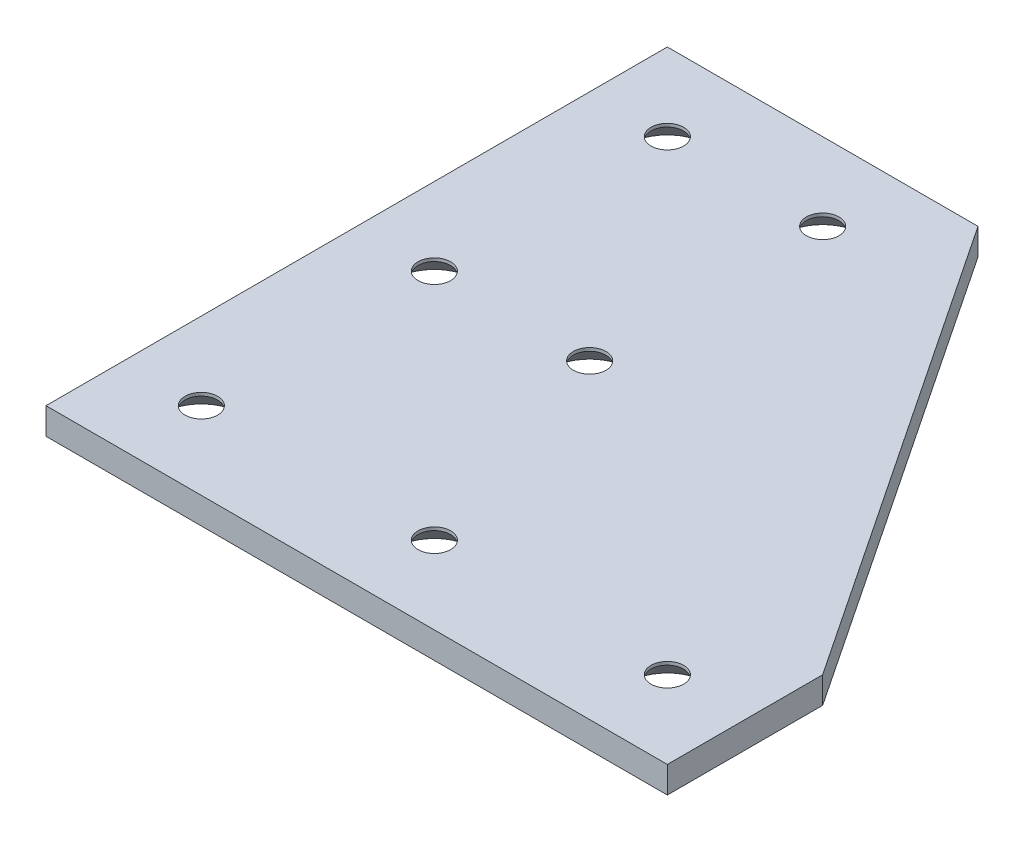
ISO-10303-21;
HEADER;
FILE_DESCRIPTION(('STEP AP214'),'2;1');
FILE_NAME('part.step','',(''),(''),'','','');
FILE_SCHEMA(('AUTOMOTIVE_DESIGN { 1 0 10303 214 1 1 1 1 }'));
ENDSEC;
DATA;
#1=APPLICATION_CONTEXT('core data for automotive mechanical design processes');
#2=APPLICATION_PROTOCOL_DEFINITION('international standard','automotive_design',2000,#1);
#3=PRODUCT_CONTEXT('',#1,'mechanical');
#4=PRODUCT('Part','Part','',(#3));
#5=PRODUCT_RELATED_PRODUCT_CATEGORY('part','',(#4));
#6=PRODUCT_DEFINITION_FORMATION('','',#4);
#7=PRODUCT_DEFINITION_CONTEXT('part definition',#1,'design');
#8=PRODUCT_DEFINITION('design','',#6,#7);
#9=PRODUCT_DEFINITION_SHAPE('','',#8);
#10=(LENGTH_UNIT() NAMED_UNIT(*) SI_UNIT(.MILLI.,.METRE.));
#11=(NAMED_UNIT(*) PLANE_ANGLE_UNIT() SI_UNIT($,.RADIAN.));
#12=(NAMED_UNIT(*) SI_UNIT($,.STERADIAN.) SOLID_ANGLE_UNIT());
#13=UNCERTAINTY_MEASURE_WITH_UNIT(LENGTH_MEASURE(1.E-05),#10,'distance_accuracy_value','');
#14=(GEOMETRIC_REPRESENTATION_CONTEXT(3) GLOBAL_UNCERTAINTY_ASSIGNED_CONTEXT((#13)) GLOBAL_UNIT_ASSIGNED_CONTEXT((#10,
#11,#12)) REPRESENTATION_CONTEXT('',''));
#15=CARTESIAN_POINT('',(0.,0.,0.));
#16=DIRECTION('',(0.,0.,1.));
#17=DIRECTION('',(1.,0.,0.));
#18=AXIS2_PLACEMENT_3D('',#15,#16,#17);
#19=CARTESIAN_POINT('',(0.,3.416,-80.));
#20=DIRECTION('',(1.,0.,0.));
#21=DIRECTION('',(0.,0.,-1.));
#22=AXIS2_PLACEMENT_3D('',#19,#20,#21);
#23=PLANE('',#22);
#24=DIRECTION('',(0.,0.,1.));
#25=VECTOR('',#24,1.);
#26=CARTESIAN_POINT('',(0.,0.,-80.));
#27=LINE('',#26,#25);
#28=CARTESIAN_POINT('',(0.,0.,-80.));
#29=VERTEX_POINT('',#28);
#30=CARTESIAN_POINT('',(0.,0.,0.));
#31=VERTEX_POINT('',#30);
#32=EDGE_CURVE('E128',#29,#31,#27,.T.);
#33=ORIENTED_EDGE('',*,*,#32,.T.);
#34=DIRECTION('',(0.,-1.,0.));
#35=VECTOR('',#34,1.);
#36=CARTESIAN_POINT('',(0.,3.416,0.));
#37=LINE('',#36,#35);
#38=CARTESIAN_POINT('',(0.,3.416,0.));
#39=VERTEX_POINT('',#38);
#40=EDGE_CURVE('E149',#39,#31,#37,.T.);
#41=ORIENTED_EDGE('',*,*,#40,.F.);
#42=DIRECTION('',(0.,0.,1.));
#43=VECTOR('',#42,1.);
#44=CARTESIAN_POINT('',(0.,3.416,-80.));
#45=LINE('',#44,#43);
#46=CARTESIAN_POINT('',(0.,3.416,-80.));
#47=VERTEX_POINT('',#46);
#48=EDGE_CURVE('E142',#47,#39,#45,.T.);
#49=ORIENTED_EDGE('',*,*,#48,.F.);
#50=DIRECTION('',(0.,-1.,0.));
#51=VECTOR('',#50,1.);
#52=CARTESIAN_POINT('',(0.,3.416,-80.));
#53=LINE('',#52,#51);
#54=EDGE_CURVE('E124',#47,#29,#53,.T.);
#55=ORIENTED_EDGE('',*,*,#54,.T.);
#56=EDGE_LOOP('',(#33,#41,#49,#55));
#57=FACE_BOUND('',#56,.T.);
#58=ADVANCED_FACE('F45',(#57),#23,.F.);
#59=CARTESIAN_POINT('',(0.,3.416,0.));
#60=DIRECTION('',(0.,0.,-1.));
#61=DIRECTION('',(-1.,0.,0.));
#62=AXIS2_PLACEMENT_3D('',#59,#60,#61);
#63=PLANE('',#62);
#64=DIRECTION('',(1.,0.,0.));
#65=VECTOR('',#64,1.);
#66=CARTESIAN_POINT('',(0.,0.,0.));
#67=LINE('',#66,#65);
#68=CARTESIAN_POINT('',(80.,0.,0.));
#69=VERTEX_POINT('',#68);
#70=EDGE_CURVE('E132',#31,#69,#67,.T.);
#71=ORIENTED_EDGE('',*,*,#70,.T.);
#72=DIRECTION('',(0.,-1.,0.));
#73=VECTOR('',#72,1.);
#74=CARTESIAN_POINT('',(80.,3.416,0.));
#75=LINE('',#74,#73);
#76=CARTESIAN_POINT('',(80.,3.416,0.));
#77=VERTEX_POINT('',#76);
#78=EDGE_CURVE('E117',#77,#69,#75,.T.);
#79=ORIENTED_EDGE('',*,*,#78,.F.);
#80=DIRECTION('',(1.,0.,0.));
#81=VECTOR('',#80,1.);
#82=CARTESIAN_POINT('',(0.,3.416,0.));
#83=LINE('',#82,#81);
#84=EDGE_CURVE('E99',#39,#77,#83,.T.);
#85=ORIENTED_EDGE('',*,*,#84,.F.);
#86=ORIENTED_EDGE('',*,*,#40,.T.);
#87=EDGE_LOOP('',(#71,#79,#85,#86));
#88=FACE_BOUND('',#87,.T.);
#89=ADVANCED_FACE('F235',(#88),#63,.F.);
#90=CARTESIAN_POINT('',(80.,3.416,0.));
#91=DIRECTION('',(-1.,0.,0.));
#92=DIRECTION('',(0.,0.,1.));
#93=AXIS2_PLACEMENT_3D('',#90,#91,#92);
#94=PLANE('',#93);
#95=DIRECTION('',(0.,0.,-1.));
#96=VECTOR('',#95,1.);
#97=CARTESIAN_POINT('',(80.,0.,0.));
#98=LINE('',#97,#96);
#99=CARTESIAN_POINT('',(80.,0.,-20.));
#100=VERTEX_POINT('',#99);
#101=EDGE_CURVE('E115',#69,#100,#98,.T.);
#102=ORIENTED_EDGE('',*,*,#101,.T.);
#103=DIRECTION('',(0.,-1.,0.));
#104=VECTOR('',#103,1.);
#105=CARTESIAN_POINT('',(80.,3.416,-20.));
#106=LINE('',#105,#104);
#107=CARTESIAN_POINT('',(80.,3.416,-20.));
#108=VERTEX_POINT('',#107);
#109=EDGE_CURVE('E112',#108,#100,#106,.T.);
#110=ORIENTED_EDGE('',*,*,#109,.F.);
#111=DIRECTION('',(0.,0.,-1.));
#112=VECTOR('',#111,1.);
#113=CARTESIAN_POINT('',(80.,3.416,0.));
#114=LINE('',#113,#112);
#115=EDGE_CURVE('E103',#77,#108,#114,.T.);
#116=ORIENTED_EDGE('',*,*,#115,.F.);
#117=ORIENTED_EDGE('',*,*,#78,.T.);
#118=EDGE_LOOP('',(#102,#110,#116,#117));
#119=FACE_BOUND('',#118,.T.);
#120=ADVANCED_FACE('F113',(#119),#94,.F.);
#121=CARTESIAN_POINT('',(80.,3.416,-20.));
#122=DIRECTION('',(-0.832050294337844,0.,0.554700196225229));
#123=DIRECTION('',(0.554700196225229,0.,0.832050294337844));
#124=AXIS2_PLACEMENT_3D('',#121,#122,#123);
#125=PLANE('',#124);
#126=DIRECTION('',(-0.554700196225229,0.,-0.832050294337844));
#127=VECTOR('',#126,1.);
#128=CARTESIAN_POINT('',(80.,0.,-20.));
#129=LINE('',#128,#127);
#130=CARTESIAN_POINT('',(40.,0.,-80.));
#131=VERTEX_POINT('',#130);
#132=EDGE_CURVE('E84',#100,#131,#129,.T.);
#133=ORIENTED_EDGE('',*,*,#132,.T.);
#134=DIRECTION('',(0.,-1.,0.));
#135=VECTOR('',#134,1.);
#136=CARTESIAN_POINT('',(40.,3.416,-80.));
#137=LINE('',#136,#135);
#138=CARTESIAN_POINT('',(40.,3.416,-80.));
#139=VERTEX_POINT('',#138);
#140=EDGE_CURVE('E118',#139,#131,#137,.T.);
#141=ORIENTED_EDGE('',*,*,#140,.F.);
#142=DIRECTION('',(-0.554700196225229,0.,-0.832050294337844));
#143=VECTOR('',#142,1.);
#144=CARTESIAN_POINT('',(80.,3.416,-20.));
#145=LINE('',#144,#143);
#146=EDGE_CURVE('E107',#108,#139,#145,.T.);
#147=ORIENTED_EDGE('',*,*,#146,.F.);
#148=ORIENTED_EDGE('',*,*,#109,.T.);
#149=EDGE_LOOP('',(#133,#141,#147,#148));
#150=FACE_BOUND('',#149,.T.);
#151=ADVANCED_FACE('F120',(#150),#125,.F.);
#152=CARTESIAN_POINT('',(40.,3.416,-80.));
#153=DIRECTION('',(0.,0.,1.));
#154=DIRECTION('',(1.,0.,0.));
#155=AXIS2_PLACEMENT_3D('',#152,#153,#154);
#156=PLANE('',#155);
#157=DIRECTION('',(-1.,0.,0.));
#158=VECTOR('',#157,1.);
#159=CARTESIAN_POINT('',(40.,0.,-80.));
#160=LINE('',#159,#158);
#161=EDGE_CURVE('E90',#131,#29,#160,.T.);
#162=ORIENTED_EDGE('',*,*,#161,.T.);
#163=ORIENTED_EDGE('',*,*,#54,.F.);
#164=DIRECTION('',(-1.,0.,0.));
#165=VECTOR('',#164,1.);
#166=CARTESIAN_POINT('',(40.,3.416,-80.));
#167=LINE('',#166,#165);
#168=EDGE_CURVE('E64',#139,#47,#167,.T.);
#169=ORIENTED_EDGE('',*,*,#168,.F.);
#170=ORIENTED_EDGE('',*,*,#140,.T.);
#171=EDGE_LOOP('',(#162,#163,#169,#170));
#172=FACE_BOUND('',#171,.T.);
#173=ADVANCED_FACE('F224',(#172),#156,.F.);
#174=CARTESIAN_POINT('',(0.,3.416,0.));
#175=DIRECTION('',(0.,1.,0.));
#176=DIRECTION('',(0.,0.,1.));
#177=AXIS2_PLACEMENT_3D('',#174,#175,#176);
#178=PLANE('',#177);
#179=CARTESIAN_POINT('',(9.99999999999979,3.416,-70.));
#180=DIRECTION('',(0.,1.,0.));
#181=DIRECTION('',(0.,0.,1.));
#182=AXIS2_PLACEMENT_3D('',#179,#180,#181);
#183=CIRCLE('',#182,2.1);
#184=CARTESIAN_POINT('',(9.99999999999979,3.416,-67.9));
#185=VERTEX_POINT('',#184);
#186=EDGE_CURVE('E304',#185,#185,#183,.T.);
#187=ORIENTED_EDGE('',*,*,#186,.F.);
#188=EDGE_LOOP('',(#187));
#189=FACE_BOUND('',#188,.T.);
#190=CARTESIAN_POINT('',(9.9999999999999,3.416,-40.));
#191=DIRECTION('',(0.,1.,0.));
#192=DIRECTION('',(0.,0.,1.));
#193=AXIS2_PLACEMENT_3D('',#190,#191,#192);
#194=CIRCLE('',#193,2.1);
#195=CARTESIAN_POINT('',(9.9999999999999,3.416,-37.9));
#196=VERTEX_POINT('',#195);
#197=EDGE_CURVE('E310',#196,#196,#194,.T.);
#198=ORIENTED_EDGE('',*,*,#197,.F.);
#199=EDGE_LOOP('',(#198));
#200=FACE_BOUND('',#199,.T.);
#201=CARTESIAN_POINT('',(29.9999999999998,3.416,-70.));
#202=DIRECTION('',(0.,1.,0.));
#203=DIRECTION('',(0.,0.,1.));
#204=AXIS2_PLACEMENT_3D('',#201,#202,#203);
#205=CIRCLE('',#204,2.1);
#206=CARTESIAN_POINT('',(29.9999999999998,3.416,-67.9));
#207=VERTEX_POINT('',#206);
#208=EDGE_CURVE('E314',#207,#207,#205,.T.);
#209=ORIENTED_EDGE('',*,*,#208,.F.);
#210=EDGE_LOOP('',(#209));
#211=FACE_BOUND('',#210,.T.);
#212=CARTESIAN_POINT('',(29.9999999999999,3.416,-40.));
#213=DIRECTION('',(0.,1.,0.));
#214=DIRECTION('',(0.,0.,1.));
#215=AXIS2_PLACEMENT_3D('',#212,#213,#214);
#216=CIRCLE('',#215,2.1);
#217=CARTESIAN_POINT('',(29.9999999999999,3.416,-37.9));
#218=VERTEX_POINT('',#217);
#219=EDGE_CURVE('E318',#218,#218,#216,.T.);
#220=ORIENTED_EDGE('',*,*,#219,.F.);
#221=EDGE_LOOP('',(#220));
#222=FACE_BOUND('',#221,.T.);
#223=CARTESIAN_POINT('',(70.,3.416,-9.99999999999999));
#224=DIRECTION('',(0.,1.,0.));
#225=DIRECTION('',(0.,0.,1.));
#226=AXIS2_PLACEMENT_3D('',#223,#224,#225);
#227=CIRCLE('',#226,2.1);
#228=CARTESIAN_POINT('',(70.,3.416,-7.89999999999999));
#229=VERTEX_POINT('',#228);
#230=EDGE_CURVE('E300',#229,#229,#227,.T.);
#231=ORIENTED_EDGE('',*,*,#230,.F.);
#232=EDGE_LOOP('',(#231));
#233=FACE_BOUND('',#232,.T.);
#234=CARTESIAN_POINT('',(40.,3.416,-9.99999999999999));
#235=DIRECTION('',(0.,1.,0.));
#236=DIRECTION('',(0.,0.,1.));
#237=AXIS2_PLACEMENT_3D('',#234,#235,#236);
#238=CIRCLE('',#237,2.1);
#239=CARTESIAN_POINT('',(40.,3.416,-7.9));
#240=VERTEX_POINT('',#239);
#241=EDGE_CURVE('E296',#240,#240,#238,.T.);
#242=ORIENTED_EDGE('',*,*,#241,.F.);
#243=EDGE_LOOP('',(#242));
#244=FACE_BOUND('',#243,.T.);
#245=CARTESIAN_POINT('',(10.,3.416,-9.99999999999999));
#246=DIRECTION('',(0.,1.,0.));
#247=DIRECTION('',(0.,0.,1.));
#248=AXIS2_PLACEMENT_3D('',#245,#246,#247);
#249=CIRCLE('',#248,2.1);
#250=CARTESIAN_POINT('',(10.,3.416,-7.89999999999999));
#251=VERTEX_POINT('',#250);
#252=EDGE_CURVE('E133',#251,#251,#249,.T.);
#253=ORIENTED_EDGE('',*,*,#252,.F.);
#254=EDGE_LOOP('',(#253));
#255=FACE_BOUND('',#254,.T.);
#256=ORIENTED_EDGE('',*,*,#48,.T.);
#257=ORIENTED_EDGE('',*,*,#84,.T.);
#258=ORIENTED_EDGE('',*,*,#115,.T.);
#259=ORIENTED_EDGE('',*,*,#146,.T.);
#260=ORIENTED_EDGE('',*,*,#168,.T.);
#261=EDGE_LOOP('',(#256,#257,#258,#259,#260));
#262=FACE_BOUND('',#261,.T.);
#263=ADVANCED_FACE('F105',(#189,#200,#211,#222,#233,#244,#255,#262),#178,.T.);
#264=CARTESIAN_POINT('',(0.,0.,0.));
#265=DIRECTION('',(0.,1.,0.));
#266=DIRECTION('',(0.,0.,1.));
#267=AXIS2_PLACEMENT_3D('',#264,#265,#266);
#268=PLANE('',#267);
#269=CARTESIAN_POINT('',(9.99999999999979,0.,-70.));
#270=DIRECTION('',(0.,1.,0.));
#271=DIRECTION('',(0.,0.,1.));
#272=AXIS2_PLACEMENT_3D('',#269,#270,#271);
#273=CIRCLE('',#272,5.10000000000001);
#274=CARTESIAN_POINT('',(9.99999999999979,0.,-64.9));
#275=VERTEX_POINT('',#274);
#276=EDGE_CURVE('E176',#275,#275,#273,.T.);
#277=ORIENTED_EDGE('',*,*,#276,.T.);
#278=EDGE_LOOP('',(#277));
#279=FACE_BOUND('',#278,.T.);
#280=CARTESIAN_POINT('',(29.9999999999998,0.,-70.));
#281=DIRECTION('',(0.,1.,0.));
#282=DIRECTION('',(0.,0.,1.));
#283=AXIS2_PLACEMENT_3D('',#280,#281,#282);
#284=CIRCLE('',#283,5.10000000000001);
#285=CARTESIAN_POINT('',(29.9999999999998,0.,-64.9));
#286=VERTEX_POINT('',#285);
#287=EDGE_CURVE('E172',#286,#286,#284,.T.);
#288=ORIENTED_EDGE('',*,*,#287,.T.);
#289=EDGE_LOOP('',(#288));
#290=FACE_BOUND('',#289,.T.);
#291=CARTESIAN_POINT('',(29.9999999999999,0.,-40.));
#292=DIRECTION('',(0.,1.,0.));
#293=DIRECTION('',(0.,0.,1.));
#294=AXIS2_PLACEMENT_3D('',#291,#292,#293);
#295=CIRCLE('',#294,5.10000000000001);
#296=CARTESIAN_POINT('',(29.9999999999999,0.,-34.9));
#297=VERTEX_POINT('',#296);
#298=EDGE_CURVE('E168',#297,#297,#295,.T.);
#299=ORIENTED_EDGE('',*,*,#298,.T.);
#300=EDGE_LOOP('',(#299));
#301=FACE_BOUND('',#300,.T.);
#302=CARTESIAN_POINT('',(9.9999999999999,0.,-40.));
#303=DIRECTION('',(0.,1.,0.));
#304=DIRECTION('',(0.,0.,1.));
#305=AXIS2_PLACEMENT_3D('',#302,#303,#304);
#306=CIRCLE('',#305,5.10000000000001);
#307=CARTESIAN_POINT('',(9.9999999999999,0.,-34.9));
#308=VERTEX_POINT('',#307);
#309=EDGE_CURVE('E164',#308,#308,#306,.T.);
#310=ORIENTED_EDGE('',*,*,#309,.T.);
#311=EDGE_LOOP('',(#310));
#312=FACE_BOUND('',#311,.T.);
#313=CARTESIAN_POINT('',(10.,0.,-9.99999999999999));
#314=DIRECTION('',(0.,1.,0.));
#315=DIRECTION('',(0.,0.,1.));
#316=AXIS2_PLACEMENT_3D('',#313,#314,#315);
#317=CIRCLE('',#316,5.10000000000001);
#318=CARTESIAN_POINT('',(10.,0.,-4.89999999999999));
#319=VERTEX_POINT('',#318);
#320=EDGE_CURVE('E160',#319,#319,#317,.T.);
#321=ORIENTED_EDGE('',*,*,#320,.T.);
#322=EDGE_LOOP('',(#321));
#323=FACE_BOUND('',#322,.T.);
#324=CARTESIAN_POINT('',(40.,0.,-9.99999999999999));
#325=DIRECTION('',(0.,1.,0.));
#326=DIRECTION('',(0.,0.,1.));
#327=AXIS2_PLACEMENT_3D('',#324,#325,#326);
#328=CIRCLE('',#327,5.10000000000001);
#329=CARTESIAN_POINT('',(40.,0.,-4.89999999999999));
#330=VERTEX_POINT('',#329);
#331=EDGE_CURVE('E156',#330,#330,#328,.T.);
#332=ORIENTED_EDGE('',*,*,#331,.T.);
#333=EDGE_LOOP('',(#332));
#334=FACE_BOUND('',#333,.T.);
#335=CARTESIAN_POINT('',(70.,0.,-9.99999999999999));
#336=DIRECTION('',(0.,1.,0.));
#337=DIRECTION('',(0.,0.,1.));
#338=AXIS2_PLACEMENT_3D('',#335,#336,#337);
#339=CIRCLE('',#338,5.10000000000001);
#340=CARTESIAN_POINT('',(70.,0.,-4.89999999999999));
#341=VERTEX_POINT('',#340);
#342=EDGE_CURVE('E152',#341,#341,#339,.T.);
#343=ORIENTED_EDGE('',*,*,#342,.T.);
#344=EDGE_LOOP('',(#343));
#345=FACE_BOUND('',#344,.T.);
#346=ORIENTED_EDGE('',*,*,#32,.F.);
#347=ORIENTED_EDGE('',*,*,#161,.F.);
#348=ORIENTED_EDGE('',*,*,#132,.F.);
#349=ORIENTED_EDGE('',*,*,#101,.F.);
#350=ORIENTED_EDGE('',*,*,#70,.F.);
#351=EDGE_LOOP('',(#346,#347,#348,#349,#350));
#352=FACE_BOUND('',#351,.T.);
#353=ADVANCED_FACE('F212',(#279,#290,#301,#312,#323,#334,#345,#352),#268,.F.);
#354=CARTESIAN_POINT('',(10.,-0.584,-9.99999999999999));
#355=DIRECTION('',(0.,1.,0.));
#356=DIRECTION('',(0.,0.,1.));
#357=AXIS2_PLACEMENT_3D('',#354,#355,#356);
#358=CYLINDRICAL_SURFACE('',#357,2.1);
#359=CARTESIAN_POINT('',(10.,3.00000000000001,-9.99999999999999));
#360=DIRECTION('',(0.,1.,0.));
#361=DIRECTION('',(0.,0.,1.));
#362=AXIS2_PLACEMENT_3D('',#359,#360,#361);
#363=CIRCLE('',#362,2.1);
#364=CARTESIAN_POINT('',(10.,3.00000000000001,-7.89999999999999));
#365=VERTEX_POINT('',#364);
#366=EDGE_CURVE('E196',#365,#365,#363,.F.);
#367=ORIENTED_EDGE('',*,*,#366,.T.);
#368=EDGE_LOOP('',(#367));
#369=FACE_BOUND('',#368,.T.);
#370=ORIENTED_EDGE('',*,*,#252,.T.);
#371=EDGE_LOOP('',(#370));
#372=FACE_BOUND('',#371,.T.);
#373=ADVANCED_FACE('F215',(#369,#372),#358,.F.);
#374=CARTESIAN_POINT('',(40.,-0.584,-9.99999999999999));
#375=DIRECTION('',(0.,1.,0.));
#376=DIRECTION('',(0.,0.,1.));
#377=AXIS2_PLACEMENT_3D('',#374,#375,#376);
#378=CYLINDRICAL_SURFACE('',#377,2.1);
#379=CARTESIAN_POINT('',(40.,3.00000000000002,-9.99999999999999));
#380=DIRECTION('',(0.,1.,0.));
#381=DIRECTION('',(0.,0.,1.));
#382=AXIS2_PLACEMENT_3D('',#379,#380,#381);
#383=CIRCLE('',#382,2.1);
#384=CARTESIAN_POINT('',(40.,3.00000000000002,-7.9));
#385=VERTEX_POINT('',#384);
#386=EDGE_CURVE('E56',#385,#385,#383,.F.);
#387=ORIENTED_EDGE('',*,*,#386,.T.);
#388=EDGE_LOOP('',(#387));
#389=FACE_BOUND('',#388,.T.);
#390=ORIENTED_EDGE('',*,*,#241,.T.);
#391=EDGE_LOOP('',(#390));
#392=FACE_BOUND('',#391,.T.);
#393=ADVANCED_FACE('F203',(#389,#392),#378,.F.);
#394=CARTESIAN_POINT('',(70.,-0.584,-9.99999999999999));
#395=DIRECTION('',(0.,1.,0.));
#396=DIRECTION('',(0.,0.,1.));
#397=AXIS2_PLACEMENT_3D('',#394,#395,#396);
#398=CYLINDRICAL_SURFACE('',#397,2.1);
#399=CARTESIAN_POINT('',(70.,3.00000000000001,-9.99999999999999));
#400=DIRECTION('',(0.,1.,0.));
#401=DIRECTION('',(0.,0.,1.));
#402=AXIS2_PLACEMENT_3D('',#399,#400,#401);
#403=CIRCLE('',#402,2.1);
#404=CARTESIAN_POINT('',(70.,3.00000000000001,-7.89999999999999));
#405=VERTEX_POINT('',#404);
#406=EDGE_CURVE('E11',#405,#405,#403,.F.);
#407=ORIENTED_EDGE('',*,*,#406,.T.);
#408=EDGE_LOOP('',(#407));
#409=FACE_BOUND('',#408,.T.);
#410=ORIENTED_EDGE('',*,*,#230,.T.);
#411=EDGE_LOOP('',(#410));
#412=FACE_BOUND('',#411,.T.);
#413=ADVANCED_FACE('F326',(#409,#412),#398,.F.);
#414=CARTESIAN_POINT('',(29.9999999999999,-0.584,-40.));
#415=DIRECTION('',(0.,1.,0.));
#416=DIRECTION('',(0.,0.,1.));
#417=AXIS2_PLACEMENT_3D('',#414,#415,#416);
#418=CYLINDRICAL_SURFACE('',#417,2.1);
#419=CARTESIAN_POINT('',(29.9999999999999,3.00000000000003,-40.));
#420=DIRECTION('',(0.,1.,0.));
#421=DIRECTION('',(0.,0.,1.));
#422=AXIS2_PLACEMENT_3D('',#419,#420,#421);
#423=CIRCLE('',#422,2.1);
#424=CARTESIAN_POINT('',(29.9999999999999,3.00000000000003,-37.9));
#425=VERTEX_POINT('',#424);
#426=EDGE_CURVE('E188',#425,#425,#423,.F.);
#427=ORIENTED_EDGE('',*,*,#426,.T.);
#428=EDGE_LOOP('',(#427));
#429=FACE_BOUND('',#428,.T.);
#430=ORIENTED_EDGE('',*,*,#219,.T.);
#431=EDGE_LOOP('',(#430));
#432=FACE_BOUND('',#431,.T.);
#433=ADVANCED_FACE('F335',(#429,#432),#418,.F.);
#434=CARTESIAN_POINT('',(29.9999999999998,-0.584,-70.));
#435=DIRECTION('',(0.,1.,0.));
#436=DIRECTION('',(0.,0.,1.));
#437=AXIS2_PLACEMENT_3D('',#434,#435,#436);
#438=CYLINDRICAL_SURFACE('',#437,2.1);
#439=CARTESIAN_POINT('',(29.9999999999998,3.00000000000002,-70.));
#440=DIRECTION('',(0.,1.,0.));
#441=DIRECTION('',(0.,0.,1.));
#442=AXIS2_PLACEMENT_3D('',#439,#440,#441);
#443=CIRCLE('',#442,2.1);
#444=CARTESIAN_POINT('',(29.9999999999998,3.00000000000002,-67.9));
#445=VERTEX_POINT('',#444);
#446=EDGE_CURVE('E184',#445,#445,#443,.F.);
#447=ORIENTED_EDGE('',*,*,#446,.T.);
#448=EDGE_LOOP('',(#447));
#449=FACE_BOUND('',#448,.T.);
#450=ORIENTED_EDGE('',*,*,#208,.T.);
#451=EDGE_LOOP('',(#450));
#452=FACE_BOUND('',#451,.T.);
#453=ADVANCED_FACE('F341',(#449,#452),#438,.F.);
#454=CARTESIAN_POINT('',(9.9999999999999,-0.584,-40.));
#455=DIRECTION('',(0.,1.,0.));
#456=DIRECTION('',(0.,0.,1.));
#457=AXIS2_PLACEMENT_3D('',#454,#455,#456);
#458=CYLINDRICAL_SURFACE('',#457,2.1);
#459=CARTESIAN_POINT('',(9.9999999999999,3.00000000000003,-40.));
#460=DIRECTION('',(0.,1.,0.));
#461=DIRECTION('',(0.,0.,1.));
#462=AXIS2_PLACEMENT_3D('',#459,#460,#461);
#463=CIRCLE('',#462,2.1);
#464=CARTESIAN_POINT('',(9.9999999999999,3.00000000000003,-37.9));
#465=VERTEX_POINT('',#464);
#466=EDGE_CURVE('E192',#465,#465,#463,.F.);
#467=ORIENTED_EDGE('',*,*,#466,.T.);
#468=EDGE_LOOP('',(#467));
#469=FACE_BOUND('',#468,.T.);
#470=ORIENTED_EDGE('',*,*,#197,.T.);
#471=EDGE_LOOP('',(#470));
#472=FACE_BOUND('',#471,.T.);
#473=ADVANCED_FACE('F345',(#469,#472),#458,.F.);
#474=CARTESIAN_POINT('',(9.99999999999979,-0.584,-70.));
#475=DIRECTION('',(0.,1.,0.));
#476=DIRECTION('',(0.,0.,1.));
#477=AXIS2_PLACEMENT_3D('',#474,#475,#476);
#478=CYLINDRICAL_SURFACE('',#477,2.1);
#479=CARTESIAN_POINT('',(9.99999999999979,3.00000000000003,-70.));
#480=DIRECTION('',(0.,1.,0.));
#481=DIRECTION('',(0.,0.,1.));
#482=AXIS2_PLACEMENT_3D('',#479,#480,#481);
#483=CIRCLE('',#482,2.1);
#484=CARTESIAN_POINT('',(9.99999999999979,3.00000000000003,-67.9));
#485=VERTEX_POINT('',#484);
#486=EDGE_CURVE('E180',#485,#485,#483,.F.);
#487=ORIENTED_EDGE('',*,*,#486,.T.);
#488=EDGE_LOOP('',(#487));
#489=FACE_BOUND('',#488,.T.);
#490=ORIENTED_EDGE('',*,*,#186,.T.);
#491=EDGE_LOOP('',(#490));
#492=FACE_BOUND('',#491,.T.);
#493=ADVANCED_FACE('F251',(#489,#492),#478,.F.);
#494=CARTESIAN_POINT('',(9.99999999999979,0.,-70.));
#495=DIRECTION('',(0.,-1.,0.));
#496=DIRECTION('',(0.,0.,-1.));
#497=AXIS2_PLACEMENT_3D('',#494,#495,#496);
#498=CONICAL_SURFACE('',#497,5.10000000000001,0.785398163397443);
#499=ORIENTED_EDGE('',*,*,#486,.F.);
#500=EDGE_LOOP('',(#499));
#501=FACE_BOUND('',#500,.T.);
#502=ORIENTED_EDGE('',*,*,#276,.F.);
#503=EDGE_LOOP('',(#502));
#504=FACE_BOUND('',#503,.T.);
#505=ADVANCED_FACE('F244',(#501,#504),#498,.F.);
#506=CARTESIAN_POINT('',(29.9999999999998,0.,-70.));
#507=DIRECTION('',(0.,-1.,0.));
#508=DIRECTION('',(0.,0.,-1.));
#509=AXIS2_PLACEMENT_3D('',#506,#507,#508);
#510=CONICAL_SURFACE('',#509,5.10000000000001,0.785398163397446);
#511=ORIENTED_EDGE('',*,*,#446,.F.);
#512=EDGE_LOOP('',(#511));
#513=FACE_BOUND('',#512,.T.);
#514=ORIENTED_EDGE('',*,*,#287,.F.);
#515=EDGE_LOOP('',(#514));
#516=FACE_BOUND('',#515,.T.);
#517=ADVANCED_FACE('F250',(#513,#516),#510,.F.);
#518=CARTESIAN_POINT('',(29.9999999999999,0.,-40.));
#519=DIRECTION('',(0.,-1.,0.));
#520=DIRECTION('',(0.,0.,-1.));
#521=AXIS2_PLACEMENT_3D('',#518,#519,#520);
#522=CONICAL_SURFACE('',#521,5.10000000000001,0.785398163397443);
#523=ORIENTED_EDGE('',*,*,#426,.F.);
#524=EDGE_LOOP('',(#523));
#525=FACE_BOUND('',#524,.T.);
#526=ORIENTED_EDGE('',*,*,#298,.F.);
#527=EDGE_LOOP('',(#526));
#528=FACE_BOUND('',#527,.T.);
#529=ADVANCED_FACE('F258',(#525,#528),#522,.F.);
#530=CARTESIAN_POINT('',(9.9999999999999,0.,-40.));
#531=DIRECTION('',(0.,-1.,0.));
#532=DIRECTION('',(0.,0.,-1.));
#533=AXIS2_PLACEMENT_3D('',#530,#531,#532);
#534=CONICAL_SURFACE('',#533,5.10000000000001,0.785398163397443);
#535=ORIENTED_EDGE('',*,*,#466,.F.);
#536=EDGE_LOOP('',(#535));
#537=FACE_BOUND('',#536,.T.);
#538=ORIENTED_EDGE('',*,*,#309,.F.);
#539=EDGE_LOOP('',(#538));
#540=FACE_BOUND('',#539,.T.);
#541=ADVANCED_FACE('F265',(#537,#540),#534,.F.);
#542=CARTESIAN_POINT('',(10.,0.,-9.99999999999999));
#543=DIRECTION('',(0.,-1.,0.));
#544=DIRECTION('',(0.,0.,-1.));
#545=AXIS2_PLACEMENT_3D('',#542,#543,#544);
#546=CONICAL_SURFACE('',#545,5.10000000000001,0.785398163397447);
#547=ORIENTED_EDGE('',*,*,#366,.F.);
#548=EDGE_LOOP('',(#547));
#549=FACE_BOUND('',#548,.T.);
#550=ORIENTED_EDGE('',*,*,#320,.F.);
#551=EDGE_LOOP('',(#550));
#552=FACE_BOUND('',#551,.T.);
#553=ADVANCED_FACE('F209',(#549,#552),#546,.F.);
#554=CARTESIAN_POINT('',(40.,0.,-9.99999999999999));
#555=DIRECTION('',(0.,-1.,0.));
#556=DIRECTION('',(0.,0.,-1.));
#557=AXIS2_PLACEMENT_3D('',#554,#555,#556);
#558=CONICAL_SURFACE('',#557,5.10000000000001,0.785398163397447);
#559=ORIENTED_EDGE('',*,*,#386,.F.);
#560=EDGE_LOOP('',(#559));
#561=FACE_BOUND('',#560,.T.);
#562=ORIENTED_EDGE('',*,*,#331,.F.);
#563=EDGE_LOOP('',(#562));
#564=FACE_BOUND('',#563,.T.);
#565=ADVANCED_FACE('F206',(#561,#564),#558,.F.);
#566=CARTESIAN_POINT('',(70.,0.,-9.99999999999999));
#567=DIRECTION('',(0.,-1.,0.));
#568=DIRECTION('',(0.,0.,-1.));
#569=AXIS2_PLACEMENT_3D('',#566,#567,#568);
#570=CONICAL_SURFACE('',#569,5.10000000000001,0.785398163397447);
#571=ORIENTED_EDGE('',*,*,#406,.F.);
#572=EDGE_LOOP('',(#571));
#573=FACE_BOUND('',#572,.T.);
#574=ORIENTED_EDGE('',*,*,#342,.F.);
#575=EDGE_LOOP('',(#574));
#576=FACE_BOUND('',#575,.T.);
#577=ADVANCED_FACE('F48',(#573,#576),#570,.F.);
#578=CLOSED_SHELL('',(#58,#89,#120,#151,#173,#263,#353,#373,#393,#413,#433,#453,#473,#493,#505,
#517,#529,#541,#553,#565,#577));
#579=MANIFOLD_SOLID_BREP('B2',#578);
#580=ADVANCED_BREP_SHAPE_REPRESENTATION('',(#18,#579),#14);
#581=SHAPE_DEFINITION_REPRESENTATION(#9,#580);
ENDSEC;
END-ISO-10303-21;
